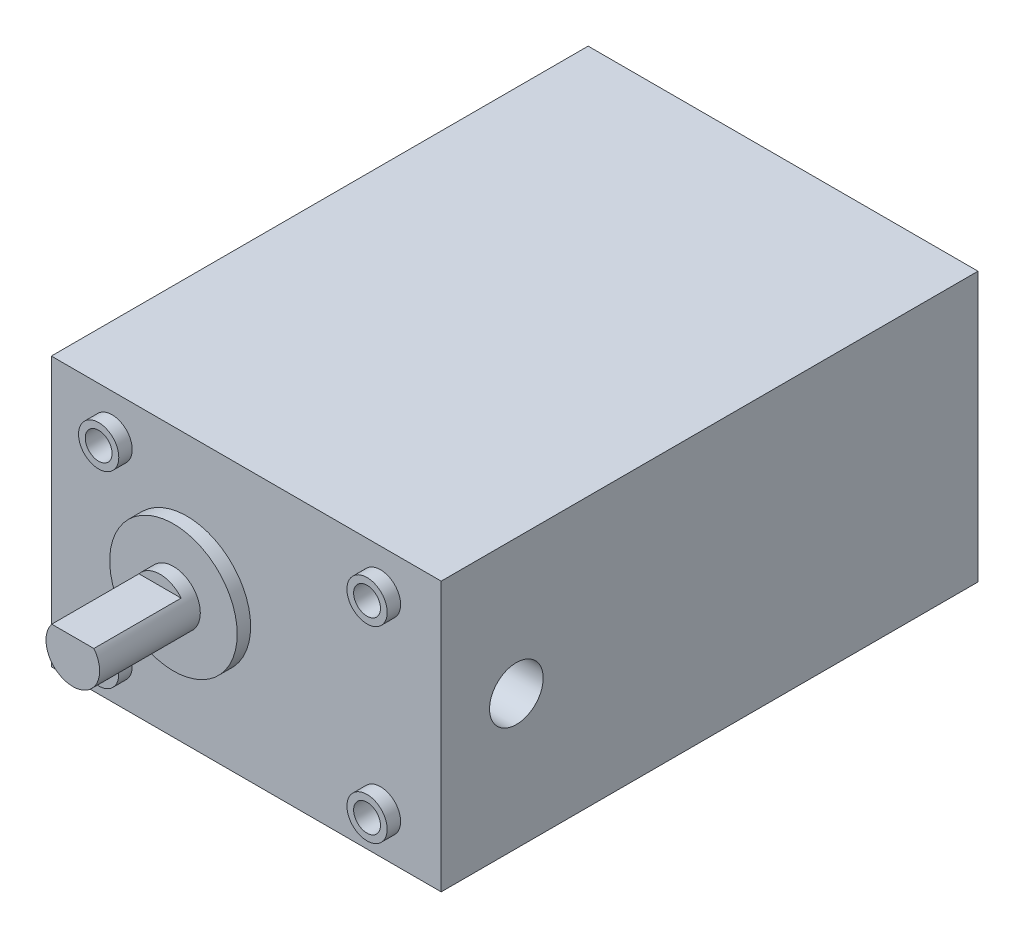
ISO-10303-21;
HEADER;
FILE_DESCRIPTION(('STEP AP214'),'2;1');
FILE_NAME('part.step','',(''),(''),'','','');
FILE_SCHEMA(('AUTOMOTIVE_DESIGN { 1 0 10303 214 1 1 1 1 }'));
ENDSEC;
DATA;
#1=APPLICATION_CONTEXT('core data for automotive mechanical design processes');
#2=APPLICATION_PROTOCOL_DEFINITION('international standard','automotive_design',2000,#1);
#3=PRODUCT_CONTEXT('',#1,'mechanical');
#4=PRODUCT('Part','Part','',(#3));
#5=PRODUCT_RELATED_PRODUCT_CATEGORY('part','',(#4));
#6=PRODUCT_DEFINITION_FORMATION('','',#4);
#7=PRODUCT_DEFINITION_CONTEXT('part definition',#1,'design');
#8=PRODUCT_DEFINITION('design','',#6,#7);
#9=PRODUCT_DEFINITION_SHAPE('','',#8);
#10=(LENGTH_UNIT() NAMED_UNIT(*) SI_UNIT(.MILLI.,.METRE.));
#11=(NAMED_UNIT(*) PLANE_ANGLE_UNIT() SI_UNIT($,.RADIAN.));
#12=(NAMED_UNIT(*) SI_UNIT($,.STERADIAN.) SOLID_ANGLE_UNIT());
#13=UNCERTAINTY_MEASURE_WITH_UNIT(LENGTH_MEASURE(1.E-05),#10,'distance_accuracy_value','');
#14=(GEOMETRIC_REPRESENTATION_CONTEXT(3) GLOBAL_UNCERTAINTY_ASSIGNED_CONTEXT((#13)) GLOBAL_UNIT_ASSIGNED_CONTEXT((#10,
#11,#12)) REPRESENTATION_CONTEXT('',''));
#15=CARTESIAN_POINT('',(0.,0.,0.));
#16=DIRECTION('',(0.,0.,1.));
#17=DIRECTION('',(1.,0.,0.));
#18=AXIS2_PLACEMENT_3D('',#15,#16,#17);
#19=CARTESIAN_POINT('',(0.,0.,80.));
#20=DIRECTION('',(1.,0.,0.));
#21=DIRECTION('',(0.,1.,0.));
#22=AXIS2_PLACEMENT_3D('',#19,#20,#21);
#23=PLANE('',#22);
#24=DIRECTION('',(0.,-1.,0.));
#25=VECTOR('',#24,1.);
#26=CARTESIAN_POINT('',(0.,0.,0.));
#27=LINE('',#26,#25);
#28=CARTESIAN_POINT('',(0.,40.11,0.));
#29=VERTEX_POINT('',#28);
#30=CARTESIAN_POINT('',(0.,0.,0.));
#31=VERTEX_POINT('',#30);
#32=EDGE_CURVE('E142',#29,#31,#27,.T.);
#33=ORIENTED_EDGE('',*,*,#32,.T.);
#34=DIRECTION('',(0.,0.,-1.));
#35=VECTOR('',#34,1.);
#36=CARTESIAN_POINT('',(0.,0.,80.));
#37=LINE('',#36,#35);
#38=CARTESIAN_POINT('',(0.,0.,80.));
#39=VERTEX_POINT('',#38);
#40=EDGE_CURVE('E146',#39,#31,#37,.T.);
#41=ORIENTED_EDGE('',*,*,#40,.F.);
#42=DIRECTION('',(0.,-1.,0.));
#43=VECTOR('',#42,1.);
#44=CARTESIAN_POINT('',(0.,0.,80.));
#45=LINE('',#44,#43);
#46=CARTESIAN_POINT('',(0.,40.11,80.));
#47=VERTEX_POINT('',#46);
#48=EDGE_CURVE('E147',#47,#39,#45,.T.);
#49=ORIENTED_EDGE('',*,*,#48,.F.);
#50=DIRECTION('',(0.,0.,-1.));
#51=VECTOR('',#50,1.);
#52=CARTESIAN_POINT('',(0.,40.11,80.));
#53=LINE('',#52,#51);
#54=EDGE_CURVE('E157',#47,#29,#53,.T.);
#55=ORIENTED_EDGE('',*,*,#54,.T.);
#56=EDGE_LOOP('',(#33,#41,#49,#55));
#57=FACE_BOUND('',#56,.T.);
#58=ADVANCED_FACE('F43',(#57),#23,.F.);
#59=CARTESIAN_POINT('',(0.,0.,80.));
#60=DIRECTION('',(0.,1.,0.));
#61=DIRECTION('',(0.,0.,1.));
#62=AXIS2_PLACEMENT_3D('',#59,#60,#61);
#63=PLANE('',#62);
#64=DIRECTION('',(1.,0.,0.));
#65=VECTOR('',#64,1.);
#66=CARTESIAN_POINT('',(0.,0.,0.));
#67=LINE('',#66,#65);
#68=CARTESIAN_POINT('',(58.1,0.,0.));
#69=VERTEX_POINT('',#68);
#70=EDGE_CURVE('E161',#31,#69,#67,.T.);
#71=ORIENTED_EDGE('',*,*,#70,.T.);
#72=DIRECTION('',(0.,0.,-1.));
#73=VECTOR('',#72,1.);
#74=CARTESIAN_POINT('',(58.1,0.,80.));
#75=LINE('',#74,#73);
#76=CARTESIAN_POINT('',(58.1,0.,80.));
#77=VERTEX_POINT('',#76);
#78=EDGE_CURVE('E174',#77,#69,#75,.T.);
#79=ORIENTED_EDGE('',*,*,#78,.F.);
#80=DIRECTION('',(1.,0.,0.));
#81=VECTOR('',#80,1.);
#82=CARTESIAN_POINT('',(0.,0.,80.));
#83=LINE('',#82,#81);
#84=EDGE_CURVE('E96',#39,#77,#83,.T.);
#85=ORIENTED_EDGE('',*,*,#84,.F.);
#86=ORIENTED_EDGE('',*,*,#40,.T.);
#87=EDGE_LOOP('',(#71,#79,#85,#86));
#88=FACE_BOUND('',#87,.T.);
#89=ADVANCED_FACE('F208',(#88),#63,.F.);
#90=CARTESIAN_POINT('',(58.1,0.,80.));
#91=DIRECTION('',(-1.,0.,0.));
#92=DIRECTION('',(0.,0.,1.));
#93=AXIS2_PLACEMENT_3D('',#90,#91,#92);
#94=PLANE('',#93);
#95=CARTESIAN_POINT('',(58.1,20.,68.7979111076917));
#96=DIRECTION('',(1.,0.,0.));
#97=DIRECTION('',(0.,0.,-1.));
#98=AXIS2_PLACEMENT_3D('',#95,#96,#97);
#99=CIRCLE('',#98,4.00000000000001);
#100=CARTESIAN_POINT('',(58.1,20.,64.7979111076917));
#101=VERTEX_POINT('',#100);
#102=EDGE_CURVE('E608',#101,#101,#99,.T.);
#103=ORIENTED_EDGE('',*,*,#102,.F.);
#104=EDGE_LOOP('',(#103));
#105=FACE_BOUND('',#104,.T.);
#106=DIRECTION('',(0.,1.,0.));
#107=VECTOR('',#106,1.);
#108=CARTESIAN_POINT('',(58.1,0.,0.));
#109=LINE('',#108,#107);
#110=CARTESIAN_POINT('',(58.1,40.11,0.));
#111=VERTEX_POINT('',#110);
#112=EDGE_CURVE('E164',#69,#111,#109,.T.);
#113=ORIENTED_EDGE('',*,*,#112,.T.);
#114=DIRECTION('',(0.,0.,-1.));
#115=VECTOR('',#114,1.);
#116=CARTESIAN_POINT('',(58.1,40.11,80.));
#117=LINE('',#116,#115);
#118=CARTESIAN_POINT('',(58.1,40.11,80.));
#119=VERTEX_POINT('',#118);
#120=EDGE_CURVE('E171',#119,#111,#117,.T.);
#121=ORIENTED_EDGE('',*,*,#120,.F.);
#122=DIRECTION('',(0.,1.,0.));
#123=VECTOR('',#122,1.);
#124=CARTESIAN_POINT('',(58.1,0.,80.));
#125=LINE('',#124,#123);
#126=EDGE_CURVE('E152',#77,#119,#125,.T.);
#127=ORIENTED_EDGE('',*,*,#126,.F.);
#128=ORIENTED_EDGE('',*,*,#78,.T.);
#129=EDGE_LOOP('',(#113,#121,#127,#128));
#130=FACE_BOUND('',#129,.T.);
#131=ADVANCED_FACE('F213',(#105,#130),#94,.F.);
#132=CARTESIAN_POINT('',(0.,40.11,80.));
#133=DIRECTION('',(0.,-1.,0.));
#134=DIRECTION('',(0.,0.,-1.));
#135=AXIS2_PLACEMENT_3D('',#132,#133,#134);
#136=PLANE('',#135);
#137=DIRECTION('',(-1.,0.,0.));
#138=VECTOR('',#137,1.);
#139=CARTESIAN_POINT('',(0.,40.11,0.));
#140=LINE('',#139,#138);
#141=EDGE_CURVE('E88',#111,#29,#140,.T.);
#142=ORIENTED_EDGE('',*,*,#141,.T.);
#143=ORIENTED_EDGE('',*,*,#54,.F.);
#144=DIRECTION('',(-1.,0.,0.));
#145=VECTOR('',#144,1.);
#146=CARTESIAN_POINT('',(0.,40.11,80.));
#147=LINE('',#146,#145);
#148=EDGE_CURVE('E67',#119,#47,#147,.T.);
#149=ORIENTED_EDGE('',*,*,#148,.F.);
#150=ORIENTED_EDGE('',*,*,#120,.T.);
#151=EDGE_LOOP('',(#142,#143,#149,#150));
#152=FACE_BOUND('',#151,.T.);
#153=ADVANCED_FACE('F196',(#152),#136,.F.);
#154=CARTESIAN_POINT('',(0.,0.,80.));
#155=DIRECTION('',(0.,0.,-1.));
#156=DIRECTION('',(-1.,0.,0.));
#157=AXIS2_PLACEMENT_3D('',#154,#155,#156);
#158=PLANE('',#157);
#159=CARTESIAN_POINT('',(9.05,6.055,80.));
#160=DIRECTION('',(0.,0.,-1.));
#161=DIRECTION('',(-1.,0.,0.));
#162=AXIS2_PLACEMENT_3D('',#159,#160,#161);
#163=CIRCLE('',#162,3.);
#164=CARTESIAN_POINT('',(6.05,6.055,80.));
#165=VERTEX_POINT('',#164);
#166=EDGE_CURVE('E11',#165,#165,#163,.F.);
#167=ORIENTED_EDGE('',*,*,#166,.F.);
#168=EDGE_LOOP('',(#167));
#169=FACE_BOUND('',#168,.T.);
#170=CARTESIAN_POINT('',(49.05,6.05500000000001,80.));
#171=DIRECTION('',(0.,0.,-1.));
#172=DIRECTION('',(-1.,0.,0.));
#173=AXIS2_PLACEMENT_3D('',#170,#171,#172);
#174=CIRCLE('',#173,3.);
#175=CARTESIAN_POINT('',(46.05,6.05500000000001,80.));
#176=VERTEX_POINT('',#175);
#177=EDGE_CURVE('E51',#176,#176,#174,.F.);
#178=ORIENTED_EDGE('',*,*,#177,.F.);
#179=EDGE_LOOP('',(#178));
#180=FACE_BOUND('',#179,.T.);
#181=CARTESIAN_POINT('',(49.05,34.055,80.));
#182=DIRECTION('',(0.,0.,-1.));
#183=DIRECTION('',(-1.,0.,0.));
#184=AXIS2_PLACEMENT_3D('',#181,#182,#183);
#185=CIRCLE('',#184,3.);
#186=CARTESIAN_POINT('',(46.05,34.055,80.));
#187=VERTEX_POINT('',#186);
#188=EDGE_CURVE('E183',#187,#187,#185,.F.);
#189=ORIENTED_EDGE('',*,*,#188,.F.);
#190=EDGE_LOOP('',(#189));
#191=FACE_BOUND('',#190,.T.);
#192=CARTESIAN_POINT('',(9.05000000000001,34.055,80.));
#193=DIRECTION('',(0.,0.,-1.));
#194=DIRECTION('',(-1.,0.,0.));
#195=AXIS2_PLACEMENT_3D('',#192,#193,#194);
#196=CIRCLE('',#195,3.);
#197=CARTESIAN_POINT('',(6.05000000000001,34.055,80.));
#198=VERTEX_POINT('',#197);
#199=EDGE_CURVE('E113',#198,#198,#196,.F.);
#200=ORIENTED_EDGE('',*,*,#199,.F.);
#201=EDGE_LOOP('',(#200));
#202=FACE_BOUND('',#201,.T.);
#203=CARTESIAN_POINT('',(20.2,20.055,80.));
#204=DIRECTION('',(0.,0.,1.));
#205=DIRECTION('',(1.,0.,0.));
#206=AXIS2_PLACEMENT_3D('',#203,#204,#205);
#207=CIRCLE('',#206,9.5);
#208=CARTESIAN_POINT('',(29.7,20.055,80.));
#209=VERTEX_POINT('',#208);
#210=EDGE_CURVE('E138',#209,#209,#207,.T.);
#211=ORIENTED_EDGE('',*,*,#210,.F.);
#212=EDGE_LOOP('',(#211));
#213=FACE_BOUND('',#212,.T.);
#214=ORIENTED_EDGE('',*,*,#48,.T.);
#215=ORIENTED_EDGE('',*,*,#84,.T.);
#216=ORIENTED_EDGE('',*,*,#126,.T.);
#217=ORIENTED_EDGE('',*,*,#148,.T.);
#218=EDGE_LOOP('',(#214,#215,#216,#217));
#219=FACE_BOUND('',#218,.T.);
#220=ADVANCED_FACE('F192',(#169,#180,#191,#202,#213,#219),#158,.F.);
#221=CARTESIAN_POINT('',(0.,0.,0.));
#222=DIRECTION('',(0.,0.,-1.));
#223=DIRECTION('',(-1.,0.,0.));
#224=AXIS2_PLACEMENT_3D('',#221,#222,#223);
#225=PLANE('',#224);
#226=ORIENTED_EDGE('',*,*,#32,.F.);
#227=ORIENTED_EDGE('',*,*,#141,.F.);
#228=ORIENTED_EDGE('',*,*,#112,.F.);
#229=ORIENTED_EDGE('',*,*,#70,.F.);
#230=EDGE_LOOP('',(#226,#227,#228,#229));
#231=FACE_BOUND('',#230,.T.);
#232=ADVANCED_FACE('F195',(#231),#225,.T.);
#233=CARTESIAN_POINT('',(20.2,20.055,82.));
#234=DIRECTION('',(0.,0.,-1.));
#235=DIRECTION('',(-1.,0.,0.));
#236=AXIS2_PLACEMENT_3D('',#233,#234,#235);
#237=CYLINDRICAL_SURFACE('',#236,9.5);
#238=CARTESIAN_POINT('',(20.2,20.055,82.));
#239=DIRECTION('',(0.,0.,1.));
#240=DIRECTION('',(1.,0.,0.));
#241=AXIS2_PLACEMENT_3D('',#238,#239,#240);
#242=CIRCLE('',#241,9.5);
#243=CARTESIAN_POINT('',(29.7,20.055,82.));
#244=VERTEX_POINT('',#243);
#245=EDGE_CURVE('E134',#244,#244,#242,.T.);
#246=ORIENTED_EDGE('',*,*,#245,.F.);
#247=EDGE_LOOP('',(#246));
#248=FACE_BOUND('',#247,.T.);
#249=ORIENTED_EDGE('',*,*,#210,.T.);
#250=EDGE_LOOP('',(#249));
#251=FACE_BOUND('',#250,.T.);
#252=ADVANCED_FACE('F216',(#248,#251),#237,.T.);
#253=CARTESIAN_POINT('',(20.2,20.055,82.));
#254=DIRECTION('',(0.,0.,1.));
#255=DIRECTION('',(1.,0.,0.));
#256=AXIS2_PLACEMENT_3D('',#253,#254,#255);
#257=PLANE('',#256);
#258=CARTESIAN_POINT('',(20.2,20.055,82.));
#259=DIRECTION('',(0.,0.,1.));
#260=DIRECTION('',(1.,0.,0.));
#261=AXIS2_PLACEMENT_3D('',#258,#259,#260);
#262=CIRCLE('',#261,4.);
#263=CARTESIAN_POINT('',(24.2,20.055,82.));
#264=VERTEX_POINT('',#263);
#265=EDGE_CURVE('E114',#264,#264,#262,.T.);
#266=ORIENTED_EDGE('',*,*,#265,.F.);
#267=EDGE_LOOP('',(#266));
#268=FACE_BOUND('',#267,.T.);
#269=ORIENTED_EDGE('',*,*,#245,.T.);
#270=EDGE_LOOP('',(#269));
#271=FACE_BOUND('',#270,.T.);
#272=ADVANCED_FACE('F221',(#268,#271),#257,.T.);
#273=CARTESIAN_POINT('',(20.2,20.055,97.));
#274=DIRECTION('',(0.,0.,-1.));
#275=DIRECTION('',(-1.,0.,0.));
#276=AXIS2_PLACEMENT_3D('',#273,#274,#275);
#277=CYLINDRICAL_SURFACE('',#276,4.);
#278=CARTESIAN_POINT('',(20.2,20.055,97.));
#279=DIRECTION('',(0.,0.,1.));
#280=DIRECTION('',(1.,0.,0.));
#281=AXIS2_PLACEMENT_3D('',#278,#279,#280);
#282=CIRCLE('',#281,4.);
#283=CARTESIAN_POINT('',(17.0615619407535,22.534960997329,97.));
#284=VERTEX_POINT('',#283);
#285=CARTESIAN_POINT('',(23.3384380592465,22.534960997329,97.));
#286=VERTEX_POINT('',#285);
#287=EDGE_CURVE('E125',#284,#286,#282,.T.);
#288=ORIENTED_EDGE('',*,*,#287,.F.);
#289=DIRECTION('',(0.,0.,1.));
#290=VECTOR('',#289,1.);
#291=CARTESIAN_POINT('',(17.0615619407535,22.534960997329,84.));
#292=LINE('',#291,#290);
#293=CARTESIAN_POINT('',(17.0615619407535,22.534960997329,84.));
#294=VERTEX_POINT('',#293);
#295=EDGE_CURVE('E58',#294,#284,#292,.T.);
#296=ORIENTED_EDGE('',*,*,#295,.F.);
#297=CARTESIAN_POINT('',(20.2,20.055,84.));
#298=DIRECTION('',(0.,0.,1.));
#299=DIRECTION('',(1.,0.,0.));
#300=AXIS2_PLACEMENT_3D('',#297,#298,#299);
#301=CIRCLE('',#300,4.);
#302=CARTESIAN_POINT('',(23.3384380592465,22.534960997329,84.));
#303=VERTEX_POINT('',#302);
#304=EDGE_CURVE('E107',#303,#294,#301,.T.);
#305=ORIENTED_EDGE('',*,*,#304,.F.);
#306=DIRECTION('',(0.,0.,1.));
#307=VECTOR('',#306,1.);
#308=CARTESIAN_POINT('',(23.3384380592465,22.534960997329,84.));
#309=LINE('',#308,#307);
#310=EDGE_CURVE('E117',#303,#286,#309,.T.);
#311=ORIENTED_EDGE('',*,*,#310,.T.);
#312=EDGE_LOOP('',(#288,#296,#305,#311));
#313=FACE_BOUND('',#312,.T.);
#314=ORIENTED_EDGE('',*,*,#265,.T.);
#315=EDGE_LOOP('',(#314));
#316=FACE_BOUND('',#315,.T.);
#317=ADVANCED_FACE('F122',(#313,#316),#277,.T.);
#318=CARTESIAN_POINT('',(20.2,20.055,97.));
#319=DIRECTION('',(0.,0.,1.));
#320=DIRECTION('',(1.,0.,0.));
#321=AXIS2_PLACEMENT_3D('',#318,#319,#320);
#322=PLANE('',#321);
#323=DIRECTION('',(1.,0.,0.));
#324=VECTOR('',#323,1.);
#325=CARTESIAN_POINT('',(17.0615619407535,22.534960997329,97.));
#326=LINE('',#325,#324);
#327=EDGE_CURVE('E119',#284,#286,#326,.T.);
#328=ORIENTED_EDGE('',*,*,#327,.F.);
#329=ORIENTED_EDGE('',*,*,#287,.T.);
#330=EDGE_LOOP('',(#328,#329));
#331=FACE_BOUND('',#330,.T.);
#332=ADVANCED_FACE('F485',(#331),#322,.T.);
#333=CARTESIAN_POINT('',(0.,0.,84.));
#334=DIRECTION('',(0.,0.,1.));
#335=DIRECTION('',(1.,0.,0.));
#336=AXIS2_PLACEMENT_3D('',#333,#334,#335);
#337=PLANE('',#336);
#338=ORIENTED_EDGE('',*,*,#304,.T.);
#339=DIRECTION('',(1.,0.,0.));
#340=VECTOR('',#339,1.);
#341=CARTESIAN_POINT('',(17.0615619407535,22.534960997329,84.));
#342=LINE('',#341,#340);
#343=EDGE_CURVE('E109',#294,#303,#342,.T.);
#344=ORIENTED_EDGE('',*,*,#343,.T.);
#345=EDGE_LOOP('',(#338,#344));
#346=FACE_BOUND('',#345,.T.);
#347=ADVANCED_FACE('F108',(#346),#337,.T.);
#348=CARTESIAN_POINT('',(17.0615619407535,22.534960997329,84.));
#349=DIRECTION('',(0.,-1.,0.));
#350=DIRECTION('',(0.,0.,-1.));
#351=AXIS2_PLACEMENT_3D('',#348,#349,#350);
#352=PLANE('',#351);
#353=ORIENTED_EDGE('',*,*,#327,.T.);
#354=ORIENTED_EDGE('',*,*,#310,.F.);
#355=ORIENTED_EDGE('',*,*,#343,.F.);
#356=ORIENTED_EDGE('',*,*,#295,.T.);
#357=EDGE_LOOP('',(#353,#354,#355,#356));
#358=FACE_BOUND('',#357,.T.);
#359=ADVANCED_FACE('F116',(#358),#352,.F.);
#360=CARTESIAN_POINT('',(9.05000000000001,34.055,82.));
#361=DIRECTION('',(0.,0.,-1.));
#362=DIRECTION('',(-1.,0.,0.));
#363=AXIS2_PLACEMENT_3D('',#360,#361,#362);
#364=CYLINDRICAL_SURFACE('',#363,3.);
#365=CARTESIAN_POINT('',(9.05000000000001,34.055,82.));
#366=DIRECTION('',(0.,0.,1.));
#367=DIRECTION('',(1.,0.,0.));
#368=AXIS2_PLACEMENT_3D('',#365,#366,#367);
#369=CIRCLE('',#368,3.);
#370=CARTESIAN_POINT('',(12.05,34.055,82.));
#371=VERTEX_POINT('',#370);
#372=EDGE_CURVE('E558',#371,#371,#369,.T.);
#373=ORIENTED_EDGE('',*,*,#372,.F.);
#374=EDGE_LOOP('',(#373));
#375=FACE_BOUND('',#374,.T.);
#376=ORIENTED_EDGE('',*,*,#199,.T.);
#377=EDGE_LOOP('',(#376));
#378=FACE_BOUND('',#377,.T.);
#379=ADVANCED_FACE('F255',(#375,#378),#364,.T.);
#380=CARTESIAN_POINT('',(9.05000000000001,34.055,82.));
#381=DIRECTION('',(0.,0.,1.));
#382=DIRECTION('',(1.,0.,0.));
#383=AXIS2_PLACEMENT_3D('',#380,#381,#382);
#384=PLANE('',#383);
#385=CARTESIAN_POINT('',(9.05000000000001,34.055,82.));
#386=DIRECTION('',(0.,0.,1.));
#387=DIRECTION('',(1.,0.,0.));
#388=AXIS2_PLACEMENT_3D('',#385,#386,#387);
#389=CIRCLE('',#388,2.);
#390=CARTESIAN_POINT('',(11.05,34.055,82.));
#391=VERTEX_POINT('',#390);
#392=EDGE_CURVE('E576',#391,#391,#389,.T.);
#393=ORIENTED_EDGE('',*,*,#392,.F.);
#394=EDGE_LOOP('',(#393));
#395=FACE_BOUND('',#394,.T.);
#396=ORIENTED_EDGE('',*,*,#372,.T.);
#397=EDGE_LOOP('',(#396));
#398=FACE_BOUND('',#397,.T.);
#399=ADVANCED_FACE('F260',(#395,#398),#384,.T.);
#400=CARTESIAN_POINT('',(49.05,34.055,82.));
#401=DIRECTION('',(0.,0.,-1.));
#402=DIRECTION('',(-1.,0.,0.));
#403=AXIS2_PLACEMENT_3D('',#400,#401,#402);
#404=CYLINDRICAL_SURFACE('',#403,3.);
#405=CARTESIAN_POINT('',(49.05,34.055,82.));
#406=DIRECTION('',(0.,0.,1.));
#407=DIRECTION('',(-1.,0.,0.));
#408=AXIS2_PLACEMENT_3D('',#405,#406,#407);
#409=CIRCLE('',#408,3.);
#410=CARTESIAN_POINT('',(46.05,34.055,82.));
#411=VERTEX_POINT('',#410);
#412=EDGE_CURVE('E561',#411,#411,#409,.T.);
#413=ORIENTED_EDGE('',*,*,#412,.F.);
#414=EDGE_LOOP('',(#413));
#415=FACE_BOUND('',#414,.T.);
#416=ORIENTED_EDGE('',*,*,#188,.T.);
#417=EDGE_LOOP('',(#416));
#418=FACE_BOUND('',#417,.T.);
#419=ADVANCED_FACE('F269',(#415,#418),#404,.T.);
#420=CARTESIAN_POINT('',(49.05,34.055,82.));
#421=DIRECTION('',(0.,0.,-1.));
#422=DIRECTION('',(-1.,0.,0.));
#423=AXIS2_PLACEMENT_3D('',#420,#421,#422);
#424=PLANE('',#423);
#425=CARTESIAN_POINT('',(49.05,34.055,82.));
#426=DIRECTION('',(0.,0.,1.));
#427=DIRECTION('',(1.,0.,0.));
#428=AXIS2_PLACEMENT_3D('',#425,#426,#427);
#429=CIRCLE('',#428,2.);
#430=CARTESIAN_POINT('',(51.05,34.055,82.));
#431=VERTEX_POINT('',#430);
#432=EDGE_CURVE('E601',#431,#431,#429,.T.);
#433=ORIENTED_EDGE('',*,*,#432,.F.);
#434=EDGE_LOOP('',(#433));
#435=FACE_BOUND('',#434,.T.);
#436=ORIENTED_EDGE('',*,*,#412,.T.);
#437=EDGE_LOOP('',(#436));
#438=FACE_BOUND('',#437,.T.);
#439=ADVANCED_FACE('F274',(#435,#438),#424,.F.);
#440=CARTESIAN_POINT('',(49.05,6.05500000000001,82.));
#441=DIRECTION('',(0.,0.,-1.));
#442=DIRECTION('',(-1.,0.,0.));
#443=AXIS2_PLACEMENT_3D('',#440,#441,#442);
#444=CYLINDRICAL_SURFACE('',#443,3.);
#445=CARTESIAN_POINT('',(49.05,6.05500000000001,82.));
#446=DIRECTION('',(0.,0.,1.));
#447=DIRECTION('',(1.,0.,0.));
#448=AXIS2_PLACEMENT_3D('',#445,#446,#447);
#449=CIRCLE('',#448,3.);
#450=CARTESIAN_POINT('',(52.05,6.05500000000001,82.));
#451=VERTEX_POINT('',#450);
#452=EDGE_CURVE('E567',#451,#451,#449,.T.);
#453=ORIENTED_EDGE('',*,*,#452,.F.);
#454=EDGE_LOOP('',(#453));
#455=FACE_BOUND('',#454,.T.);
#456=ORIENTED_EDGE('',*,*,#177,.T.);
#457=EDGE_LOOP('',(#456));
#458=FACE_BOUND('',#457,.T.);
#459=ADVANCED_FACE('F190',(#455,#458),#444,.T.);
#460=CARTESIAN_POINT('',(49.05,6.05500000000001,82.));
#461=DIRECTION('',(0.,0.,1.));
#462=DIRECTION('',(1.,0.,0.));
#463=AXIS2_PLACEMENT_3D('',#460,#461,#462);
#464=PLANE('',#463);
#465=CARTESIAN_POINT('',(49.05,6.05500000000001,82.));
#466=DIRECTION('',(0.,0.,1.));
#467=DIRECTION('',(1.,0.,0.));
#468=AXIS2_PLACEMENT_3D('',#465,#466,#467);
#469=CIRCLE('',#468,2.);
#470=CARTESIAN_POINT('',(51.05,6.05500000000001,82.));
#471=VERTEX_POINT('',#470);
#472=EDGE_CURVE('E593',#471,#471,#469,.T.);
#473=ORIENTED_EDGE('',*,*,#472,.F.);
#474=EDGE_LOOP('',(#473));
#475=FACE_BOUND('',#474,.T.);
#476=ORIENTED_EDGE('',*,*,#452,.T.);
#477=EDGE_LOOP('',(#476));
#478=FACE_BOUND('',#477,.T.);
#479=ADVANCED_FACE('F287',(#475,#478),#464,.T.);
#480=CARTESIAN_POINT('',(9.05,6.055,82.));
#481=DIRECTION('',(0.,0.,-1.));
#482=DIRECTION('',(-1.,0.,0.));
#483=AXIS2_PLACEMENT_3D('',#480,#481,#482);
#484=CYLINDRICAL_SURFACE('',#483,3.);
#485=CARTESIAN_POINT('',(9.05,6.055,82.));
#486=DIRECTION('',(0.,0.,1.));
#487=DIRECTION('',(-1.,0.,0.));
#488=AXIS2_PLACEMENT_3D('',#485,#486,#487);
#489=CIRCLE('',#488,3.);
#490=CARTESIAN_POINT('',(6.05,6.055,82.));
#491=VERTEX_POINT('',#490);
#492=EDGE_CURVE('E571',#491,#491,#489,.T.);
#493=ORIENTED_EDGE('',*,*,#492,.F.);
#494=EDGE_LOOP('',(#493));
#495=FACE_BOUND('',#494,.T.);
#496=ORIENTED_EDGE('',*,*,#166,.T.);
#497=EDGE_LOOP('',(#496));
#498=FACE_BOUND('',#497,.T.);
#499=ADVANCED_FACE('F296',(#495,#498),#484,.T.);
#500=CARTESIAN_POINT('',(9.05,6.055,82.));
#501=DIRECTION('',(0.,0.,-1.));
#502=DIRECTION('',(-1.,0.,0.));
#503=AXIS2_PLACEMENT_3D('',#500,#501,#502);
#504=PLANE('',#503);
#505=CARTESIAN_POINT('',(9.05,6.055,82.));
#506=DIRECTION('',(0.,0.,1.));
#507=DIRECTION('',(1.,0.,0.));
#508=AXIS2_PLACEMENT_3D('',#505,#506,#507);
#509=CIRCLE('',#508,2.);
#510=CARTESIAN_POINT('',(11.05,6.055,82.));
#511=VERTEX_POINT('',#510);
#512=EDGE_CURVE('E584',#511,#511,#509,.T.);
#513=ORIENTED_EDGE('',*,*,#512,.F.);
#514=EDGE_LOOP('',(#513));
#515=FACE_BOUND('',#514,.T.);
#516=ORIENTED_EDGE('',*,*,#492,.T.);
#517=EDGE_LOOP('',(#516));
#518=FACE_BOUND('',#517,.T.);
#519=ADVANCED_FACE('F301',(#515,#518),#504,.F.);
#520=CARTESIAN_POINT('',(9.05,6.055,74.));
#521=DIRECTION('',(0.,0.,1.));
#522=DIRECTION('',(1.,0.,0.));
#523=AXIS2_PLACEMENT_3D('',#520,#521,#522);
#524=CYLINDRICAL_SURFACE('',#523,2.);
#525=CARTESIAN_POINT('',(9.05,6.055,74.));
#526=DIRECTION('',(0.,0.,1.));
#527=DIRECTION('',(1.,0.,0.));
#528=AXIS2_PLACEMENT_3D('',#525,#526,#527);
#529=CIRCLE('',#528,2.);
#530=CARTESIAN_POINT('',(11.05,6.055,74.));
#531=VERTEX_POINT('',#530);
#532=EDGE_CURVE('E588',#531,#531,#529,.T.);
#533=ORIENTED_EDGE('',*,*,#532,.F.);
#534=EDGE_LOOP('',(#533));
#535=FACE_BOUND('',#534,.T.);
#536=ORIENTED_EDGE('',*,*,#512,.T.);
#537=EDGE_LOOP('',(#536));
#538=FACE_BOUND('',#537,.T.);
#539=ADVANCED_FACE('F336',(#535,#538),#524,.F.);
#540=CARTESIAN_POINT('',(9.05,6.055,74.));
#541=DIRECTION('',(0.,0.,1.));
#542=DIRECTION('',(1.,0.,0.));
#543=AXIS2_PLACEMENT_3D('',#540,#541,#542);
#544=PLANE('',#543);
#545=ORIENTED_EDGE('',*,*,#532,.T.);
#546=EDGE_LOOP('',(#545));
#547=FACE_BOUND('',#546,.T.);
#548=ADVANCED_FACE('F347',(#547),#544,.T.);
#549=CARTESIAN_POINT('',(49.05,6.05500000000001,74.));
#550=DIRECTION('',(0.,0.,1.));
#551=DIRECTION('',(1.,0.,0.));
#552=AXIS2_PLACEMENT_3D('',#549,#550,#551);
#553=CYLINDRICAL_SURFACE('',#552,2.);
#554=CARTESIAN_POINT('',(49.05,6.05500000000001,74.));
#555=DIRECTION('',(0.,0.,1.));
#556=DIRECTION('',(1.,0.,0.));
#557=AXIS2_PLACEMENT_3D('',#554,#555,#556);
#558=CIRCLE('',#557,2.);
#559=CARTESIAN_POINT('',(51.05,6.05500000000001,74.));
#560=VERTEX_POINT('',#559);
#561=EDGE_CURVE('E597',#560,#560,#558,.T.);
#562=ORIENTED_EDGE('',*,*,#561,.F.);
#563=EDGE_LOOP('',(#562));
#564=FACE_BOUND('',#563,.T.);
#565=ORIENTED_EDGE('',*,*,#472,.T.);
#566=EDGE_LOOP('',(#565));
#567=FACE_BOUND('',#566,.T.);
#568=ADVANCED_FACE('F358',(#564,#567),#553,.F.);
#569=CARTESIAN_POINT('',(49.05,6.05500000000001,74.));
#570=DIRECTION('',(0.,0.,1.));
#571=DIRECTION('',(1.,0.,0.));
#572=AXIS2_PLACEMENT_3D('',#569,#570,#571);
#573=PLANE('',#572);
#574=ORIENTED_EDGE('',*,*,#561,.T.);
#575=EDGE_LOOP('',(#574));
#576=FACE_BOUND('',#575,.T.);
#577=ADVANCED_FACE('F369',(#576),#573,.T.);
#578=CARTESIAN_POINT('',(49.05,34.055,74.));
#579=DIRECTION('',(0.,0.,1.));
#580=DIRECTION('',(1.,0.,0.));
#581=AXIS2_PLACEMENT_3D('',#578,#579,#580);
#582=CYLINDRICAL_SURFACE('',#581,2.);
#583=CARTESIAN_POINT('',(49.05,34.055,74.));
#584=DIRECTION('',(0.,0.,1.));
#585=DIRECTION('',(1.,0.,0.));
#586=AXIS2_PLACEMENT_3D('',#583,#584,#585);
#587=CIRCLE('',#586,2.);
#588=CARTESIAN_POINT('',(51.05,34.055,74.));
#589=VERTEX_POINT('',#588);
#590=EDGE_CURVE('E580',#589,#589,#587,.T.);
#591=ORIENTED_EDGE('',*,*,#590,.F.);
#592=EDGE_LOOP('',(#591));
#593=FACE_BOUND('',#592,.T.);
#594=ORIENTED_EDGE('',*,*,#432,.T.);
#595=EDGE_LOOP('',(#594));
#596=FACE_BOUND('',#595,.T.);
#597=ADVANCED_FACE('F380',(#593,#596),#582,.F.);
#598=CARTESIAN_POINT('',(49.05,34.055,74.));
#599=DIRECTION('',(0.,0.,1.));
#600=DIRECTION('',(1.,0.,0.));
#601=AXIS2_PLACEMENT_3D('',#598,#599,#600);
#602=PLANE('',#601);
#603=ORIENTED_EDGE('',*,*,#590,.T.);
#604=EDGE_LOOP('',(#603));
#605=FACE_BOUND('',#604,.T.);
#606=ADVANCED_FACE('F391',(#605),#602,.T.);
#607=CARTESIAN_POINT('',(9.05000000000001,34.055,74.));
#608=DIRECTION('',(0.,0.,1.));
#609=DIRECTION('',(1.,0.,0.));
#610=AXIS2_PLACEMENT_3D('',#607,#608,#609);
#611=CYLINDRICAL_SURFACE('',#610,2.);
#612=CARTESIAN_POINT('',(9.05000000000001,34.055,74.));
#613=DIRECTION('',(0.,0.,1.));
#614=DIRECTION('',(1.,0.,0.));
#615=AXIS2_PLACEMENT_3D('',#612,#613,#614);
#616=CIRCLE('',#615,2.);
#617=CARTESIAN_POINT('',(11.05,34.055,74.));
#618=VERTEX_POINT('',#617);
#619=EDGE_CURVE('E575',#618,#618,#616,.T.);
#620=ORIENTED_EDGE('',*,*,#619,.F.);
#621=EDGE_LOOP('',(#620));
#622=FACE_BOUND('',#621,.T.);
#623=ORIENTED_EDGE('',*,*,#392,.T.);
#624=EDGE_LOOP('',(#623));
#625=FACE_BOUND('',#624,.T.);
#626=ADVANCED_FACE('F402',(#622,#625),#611,.F.);
#627=CARTESIAN_POINT('',(9.05000000000001,34.055,74.));
#628=DIRECTION('',(0.,0.,1.));
#629=DIRECTION('',(1.,0.,0.));
#630=AXIS2_PLACEMENT_3D('',#627,#628,#629);
#631=PLANE('',#630);
#632=ORIENTED_EDGE('',*,*,#619,.T.);
#633=EDGE_LOOP('',(#632));
#634=FACE_BOUND('',#633,.T.);
#635=ADVANCED_FACE('F413',(#634),#631,.T.);
#636=CARTESIAN_POINT('',(32.7,20.,68.7979111076917));
#637=DIRECTION('',(1.,0.,0.));
#638=DIRECTION('',(0.,0.,-1.));
#639=AXIS2_PLACEMENT_3D('',#636,#637,#638);
#640=CYLINDRICAL_SURFACE('',#639,4.00000000000001);
#641=CARTESIAN_POINT('',(32.7,20.,68.7979111076917));
#642=DIRECTION('',(1.,0.,0.));
#643=DIRECTION('',(0.,0.,-1.));
#644=AXIS2_PLACEMENT_3D('',#641,#642,#643);
#645=CIRCLE('',#644,4.00000000000001);
#646=CARTESIAN_POINT('',(32.7,20.,64.7979111076917));
#647=VERTEX_POINT('',#646);
#648=EDGE_CURVE('E589',#647,#647,#645,.T.);
#649=ORIENTED_EDGE('',*,*,#648,.F.);
#650=EDGE_LOOP('',(#649));
#651=FACE_BOUND('',#650,.T.);
#652=ORIENTED_EDGE('',*,*,#102,.T.);
#653=EDGE_LOOP('',(#652));
#654=FACE_BOUND('',#653,.T.);
#655=ADVANCED_FACE('F423',(#651,#654),#640,.F.);
#656=CARTESIAN_POINT('',(32.7,20.,68.7979111076917));
#657=DIRECTION('',(1.,0.,0.));
#658=DIRECTION('',(0.,0.,-1.));
#659=AXIS2_PLACEMENT_3D('',#656,#657,#658);
#660=PLANE('',#659);
#661=ORIENTED_EDGE('',*,*,#648,.T.);
#662=EDGE_LOOP('',(#661));
#663=FACE_BOUND('',#662,.T.);
#664=ADVANCED_FACE('F441',(#663),#660,.T.);
#665=CLOSED_SHELL('',(#58,#89,#131,#153,#220,#232,#252,#272,#317,#332,#347,#359,#379,#399,#419,
#439,#459,#479,#499,#519,#539,#548,#568,#577,#597,#606,#626,#635,#655,#664));
#666=MANIFOLD_SOLID_BREP('B2',#665);
#667=ADVANCED_BREP_SHAPE_REPRESENTATION('',(#18,#666),#14);
#668=SHAPE_DEFINITION_REPRESENTATION(#9,#667);
ENDSEC;
END-ISO-10303-21;
